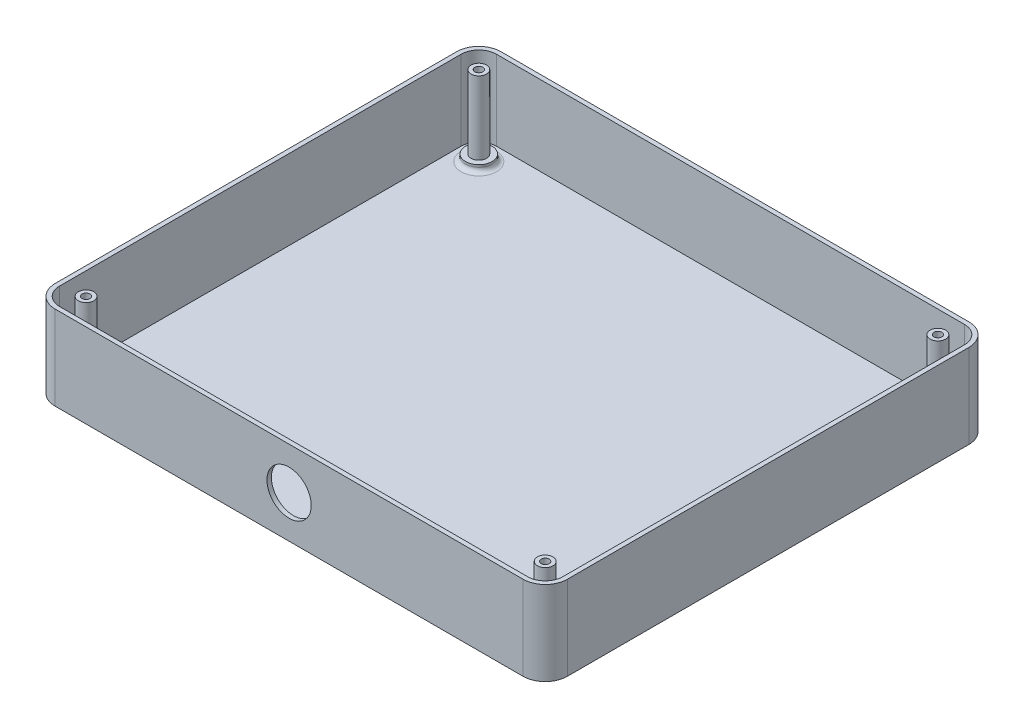
ISO-10303-21;
HEADER;
FILE_DESCRIPTION(('STEP AP214'),'2;1');
FILE_NAME('part.step','',(''),(''),'','','');
FILE_SCHEMA(('AUTOMOTIVE_DESIGN { 1 0 10303 214 1 1 1 1 }'));
ENDSEC;
DATA;
#1=APPLICATION_CONTEXT('core data for automotive mechanical design processes');
#2=APPLICATION_PROTOCOL_DEFINITION('international standard','automotive_design',2000,#1);
#3=PRODUCT_CONTEXT('',#1,'mechanical');
#4=PRODUCT('Part','Part','',(#3));
#5=PRODUCT_RELATED_PRODUCT_CATEGORY('part','',(#4));
#6=PRODUCT_DEFINITION_FORMATION('','',#4);
#7=PRODUCT_DEFINITION_CONTEXT('part definition',#1,'design');
#8=PRODUCT_DEFINITION('design','',#6,#7);
#9=PRODUCT_DEFINITION_SHAPE('','',#8);
#10=(LENGTH_UNIT() NAMED_UNIT(*) SI_UNIT(.MILLI.,.METRE.));
#11=(NAMED_UNIT(*) PLANE_ANGLE_UNIT() SI_UNIT($,.RADIAN.));
#12=(NAMED_UNIT(*) SI_UNIT($,.STERADIAN.) SOLID_ANGLE_UNIT());
#13=UNCERTAINTY_MEASURE_WITH_UNIT(LENGTH_MEASURE(1.E-05),#10,'distance_accuracy_value','');
#14=(GEOMETRIC_REPRESENTATION_CONTEXT(3) GLOBAL_UNCERTAINTY_ASSIGNED_CONTEXT((#13)) GLOBAL_UNIT_ASSIGNED_CONTEXT((#10,
#11,#12)) REPRESENTATION_CONTEXT('',''));
#15=CARTESIAN_POINT('',(0.,0.,0.));
#16=DIRECTION('',(0.,0.,1.));
#17=DIRECTION('',(1.,0.,0.));
#18=AXIS2_PLACEMENT_3D('',#15,#16,#17);
#19=CARTESIAN_POINT('',(-115.7,38.,-100.7));
#20=DIRECTION('',(1.,0.,0.));
#21=DIRECTION('',(0.,0.,-1.));
#22=AXIS2_PLACEMENT_3D('',#19,#20,#21);
#23=PLANE('',#22);
#24=DIRECTION('',(0.,0.,1.));
#25=VECTOR('',#24,1.);
#26=CARTESIAN_POINT('',(-115.7,38.,-100.7));
#27=LINE('',#26,#25);
#28=CARTESIAN_POINT('',(-115.7,38.,-90.7));
#29=VERTEX_POINT('',#28);
#30=CARTESIAN_POINT('',(-115.7,38.,90.7));
#31=VERTEX_POINT('',#30);
#32=EDGE_CURVE('E217',#29,#31,#27,.T.);
#33=ORIENTED_EDGE('',*,*,#32,.F.);
#34=DIRECTION('',(0.,-1.,0.));
#35=VECTOR('',#34,1.);
#36=CARTESIAN_POINT('',(-115.7,38.,-90.7));
#37=LINE('',#36,#35);
#38=CARTESIAN_POINT('',(-115.7,0.,-90.7));
#39=VERTEX_POINT('',#38);
#40=EDGE_CURVE('E251',#29,#39,#37,.T.);
#41=ORIENTED_EDGE('',*,*,#40,.T.);
#42=DIRECTION('',(0.,0.,1.));
#43=VECTOR('',#42,1.);
#44=CARTESIAN_POINT('',(-115.7,0.,-100.7));
#45=LINE('',#44,#43);
#46=CARTESIAN_POINT('',(-115.7,0.,90.7));
#47=VERTEX_POINT('',#46);
#48=EDGE_CURVE('E234',#39,#47,#45,.T.);
#49=ORIENTED_EDGE('',*,*,#48,.T.);
#50=DIRECTION('',(0.,-1.,0.));
#51=VECTOR('',#50,1.);
#52=CARTESIAN_POINT('',(-115.7,38.,90.7));
#53=LINE('',#52,#51);
#54=EDGE_CURVE('E233',#47,#31,#53,.F.);
#55=ORIENTED_EDGE('',*,*,#54,.T.);
#56=EDGE_LOOP('',(#33,#41,#49,#55));
#57=FACE_BOUND('',#56,.T.);
#58=ADVANCED_FACE('F39',(#57),#23,.F.);
#59=CARTESIAN_POINT('',(-115.7,38.,100.7));
#60=DIRECTION('',(0.,0.,-1.));
#61=DIRECTION('',(-1.,0.,0.));
#62=AXIS2_PLACEMENT_3D('',#59,#60,#61);
#63=PLANE('',#62);
#64=CARTESIAN_POINT('',(0.,19.,100.7));
#65=DIRECTION('',(0.,0.,1.));
#66=DIRECTION('',(1.,0.,0.));
#67=AXIS2_PLACEMENT_3D('',#64,#65,#66);
#68=CIRCLE('',#67,10.);
#69=CARTESIAN_POINT('',(10.,19.,100.7));
#70=VERTEX_POINT('',#69);
#71=EDGE_CURVE('E463',#70,#70,#68,.T.);
#72=ORIENTED_EDGE('',*,*,#71,.F.);
#73=EDGE_LOOP('',(#72));
#74=FACE_BOUND('',#73,.T.);
#75=DIRECTION('',(1.,0.,0.));
#76=VECTOR('',#75,1.);
#77=CARTESIAN_POINT('',(-115.7,0.,100.7));
#78=LINE('',#77,#76);
#79=CARTESIAN_POINT('',(-105.7,0.,100.7));
#80=VERTEX_POINT('',#79);
#81=CARTESIAN_POINT('',(105.7,0.,100.7));
#82=VERTEX_POINT('',#81);
#83=EDGE_CURVE('E238',#80,#82,#78,.T.);
#84=ORIENTED_EDGE('',*,*,#83,.T.);
#85=DIRECTION('',(0.,-1.,0.));
#86=VECTOR('',#85,1.);
#87=CARTESIAN_POINT('',(105.7,38.,100.7));
#88=LINE('',#87,#86);
#89=CARTESIAN_POINT('',(105.7,38.,100.7));
#90=VERTEX_POINT('',#89);
#91=EDGE_CURVE('E296',#82,#90,#88,.F.);
#92=ORIENTED_EDGE('',*,*,#91,.T.);
#93=DIRECTION('',(1.,0.,0.));
#94=VECTOR('',#93,1.);
#95=CARTESIAN_POINT('',(-115.7,38.,100.7));
#96=LINE('',#95,#94);
#97=CARTESIAN_POINT('',(-105.7,38.,100.7));
#98=VERTEX_POINT('',#97);
#99=EDGE_CURVE('E221',#98,#90,#96,.T.);
#100=ORIENTED_EDGE('',*,*,#99,.F.);
#101=DIRECTION('',(0.,-1.,0.));
#102=VECTOR('',#101,1.);
#103=CARTESIAN_POINT('',(-105.7,38.,100.7));
#104=LINE('',#103,#102);
#105=EDGE_CURVE('E292',#98,#80,#104,.T.);
#106=ORIENTED_EDGE('',*,*,#105,.T.);
#107=EDGE_LOOP('',(#84,#92,#100,#106));
#108=FACE_BOUND('',#107,.T.);
#109=ADVANCED_FACE('F357',(#74,#108),#63,.F.);
#110=CARTESIAN_POINT('',(115.7,38.,-100.7));
#111=DIRECTION('',(-1.,0.,0.));
#112=DIRECTION('',(0.,0.,1.));
#113=AXIS2_PLACEMENT_3D('',#110,#111,#112);
#114=PLANE('',#113);
#115=DIRECTION('',(0.,0.,-1.));
#116=VECTOR('',#115,1.);
#117=CARTESIAN_POINT('',(115.7,0.,-100.7));
#118=LINE('',#117,#116);
#119=CARTESIAN_POINT('',(115.7,0.,90.6999999999999));
#120=VERTEX_POINT('',#119);
#121=CARTESIAN_POINT('',(115.7,0.,-90.7));
#122=VERTEX_POINT('',#121);
#123=EDGE_CURVE('E243',#120,#122,#118,.T.);
#124=ORIENTED_EDGE('',*,*,#123,.T.);
#125=DIRECTION('',(0.,-1.,0.));
#126=VECTOR('',#125,1.);
#127=CARTESIAN_POINT('',(115.7,38.,-90.7));
#128=LINE('',#127,#126);
#129=CARTESIAN_POINT('',(115.7,38.,-90.7));
#130=VERTEX_POINT('',#129);
#131=EDGE_CURVE('E63',#122,#130,#128,.F.);
#132=ORIENTED_EDGE('',*,*,#131,.T.);
#133=DIRECTION('',(0.,0.,-1.));
#134=VECTOR('',#133,1.);
#135=CARTESIAN_POINT('',(115.7,38.,-100.7));
#136=LINE('',#135,#134);
#137=CARTESIAN_POINT('',(115.7,38.,90.6999999999999));
#138=VERTEX_POINT('',#137);
#139=EDGE_CURVE('E226',#138,#130,#136,.T.);
#140=ORIENTED_EDGE('',*,*,#139,.F.);
#141=DIRECTION('',(0.,-1.,0.));
#142=VECTOR('',#141,1.);
#143=CARTESIAN_POINT('',(115.7,38.,90.7));
#144=LINE('',#143,#142);
#145=EDGE_CURVE('E286',#138,#120,#144,.T.);
#146=ORIENTED_EDGE('',*,*,#145,.T.);
#147=EDGE_LOOP('',(#124,#132,#140,#146));
#148=FACE_BOUND('',#147,.T.);
#149=ADVANCED_FACE('F363',(#148),#114,.F.);
#150=CARTESIAN_POINT('',(-115.7,38.,-100.7));
#151=DIRECTION('',(0.,0.,1.));
#152=DIRECTION('',(1.,0.,0.));
#153=AXIS2_PLACEMENT_3D('',#150,#151,#152);
#154=PLANE('',#153);
#155=DIRECTION('',(-1.,0.,0.));
#156=VECTOR('',#155,1.);
#157=CARTESIAN_POINT('',(-115.7,0.,-100.7));
#158=LINE('',#157,#156);
#159=CARTESIAN_POINT('',(105.7,0.,-100.7));
#160=VERTEX_POINT('',#159);
#161=CARTESIAN_POINT('',(-105.7,0.,-100.7));
#162=VERTEX_POINT('',#161);
#163=EDGE_CURVE('E222',#160,#162,#158,.T.);
#164=ORIENTED_EDGE('',*,*,#163,.T.);
#165=DIRECTION('',(0.,-1.,0.));
#166=VECTOR('',#165,1.);
#167=CARTESIAN_POINT('',(-105.7,38.,-100.7));
#168=LINE('',#167,#166);
#169=CARTESIAN_POINT('',(-105.7,38.,-100.7));
#170=VERTEX_POINT('',#169);
#171=EDGE_CURVE('E271',#162,#170,#168,.F.);
#172=ORIENTED_EDGE('',*,*,#171,.T.);
#173=DIRECTION('',(-1.,0.,0.));
#174=VECTOR('',#173,1.);
#175=CARTESIAN_POINT('',(-115.7,38.,-100.7));
#176=LINE('',#175,#174);
#177=CARTESIAN_POINT('',(105.7,38.,-100.7));
#178=VERTEX_POINT('',#177);
#179=EDGE_CURVE('E229',#178,#170,#176,.T.);
#180=ORIENTED_EDGE('',*,*,#179,.F.);
#181=DIRECTION('',(0.,-1.,0.));
#182=VECTOR('',#181,1.);
#183=CARTESIAN_POINT('',(105.7,38.,-100.7));
#184=LINE('',#183,#182);
#185=EDGE_CURVE('E267',#178,#160,#184,.T.);
#186=ORIENTED_EDGE('',*,*,#185,.T.);
#187=EDGE_LOOP('',(#164,#172,#180,#186));
#188=FACE_BOUND('',#187,.T.);
#189=ADVANCED_FACE('F550',(#188),#154,.F.);
#190=CARTESIAN_POINT('',(0.,38.,0.));
#191=DIRECTION('',(0.,1.,0.));
#192=DIRECTION('',(0.,0.,1.));
#193=AXIS2_PLACEMENT_3D('',#190,#191,#192);
#194=PLANE('',#193);
#195=DIRECTION('',(-1.,0.,0.));
#196=VECTOR('',#195,1.);
#197=CARTESIAN_POINT('',(-115.7,38.,-98.7));
#198=LINE('',#197,#196);
#199=CARTESIAN_POINT('',(105.7,38.,-98.7));
#200=VERTEX_POINT('',#199);
#201=CARTESIAN_POINT('',(-105.7,38.,-98.7));
#202=VERTEX_POINT('',#201);
#203=EDGE_CURVE('E184',#200,#202,#198,.T.);
#204=ORIENTED_EDGE('',*,*,#203,.F.);
#205=CARTESIAN_POINT('',(105.7,38.,-90.7));
#206=DIRECTION('',(0.,1.,0.));
#207=DIRECTION('',(0.,0.,1.));
#208=AXIS2_PLACEMENT_3D('',#205,#206,#207);
#209=CIRCLE('',#208,8.);
#210=CARTESIAN_POINT('',(113.7,38.,-90.7));
#211=VERTEX_POINT('',#210);
#212=EDGE_CURVE('E205',#211,#200,#209,.T.);
#213=ORIENTED_EDGE('',*,*,#212,.F.);
#214=DIRECTION('',(0.,0.,-1.));
#215=VECTOR('',#214,1.);
#216=CARTESIAN_POINT('',(113.7,38.,-100.7));
#217=LINE('',#216,#215);
#218=CARTESIAN_POINT('',(113.7,38.,90.6999999999999));
#219=VERTEX_POINT('',#218);
#220=EDGE_CURVE('E55',#219,#211,#217,.T.);
#221=ORIENTED_EDGE('',*,*,#220,.F.);
#222=CARTESIAN_POINT('',(105.7,38.,90.7));
#223=DIRECTION('',(0.,1.,0.));
#224=DIRECTION('',(0.,0.,1.));
#225=AXIS2_PLACEMENT_3D('',#222,#223,#224);
#226=CIRCLE('',#225,8.);
#227=CARTESIAN_POINT('',(105.7,38.,98.7));
#228=VERTEX_POINT('',#227);
#229=EDGE_CURVE('E191',#228,#219,#226,.T.);
#230=ORIENTED_EDGE('',*,*,#229,.F.);
#231=DIRECTION('',(1.,0.,0.));
#232=VECTOR('',#231,1.);
#233=CARTESIAN_POINT('',(-115.7,38.,98.7));
#234=LINE('',#233,#232);
#235=CARTESIAN_POINT('',(-105.7,38.,98.7));
#236=VERTEX_POINT('',#235);
#237=EDGE_CURVE('E198',#236,#228,#234,.T.);
#238=ORIENTED_EDGE('',*,*,#237,.F.);
#239=CARTESIAN_POINT('',(-105.7,38.,90.7));
#240=DIRECTION('',(0.,1.,0.));
#241=DIRECTION('',(0.,0.,1.));
#242=AXIS2_PLACEMENT_3D('',#239,#240,#241);
#243=CIRCLE('',#242,8.);
#244=CARTESIAN_POINT('',(-113.7,38.,90.7));
#245=VERTEX_POINT('',#244);
#246=EDGE_CURVE('E187',#245,#236,#243,.T.);
#247=ORIENTED_EDGE('',*,*,#246,.F.);
#248=DIRECTION('',(0.,0.,1.));
#249=VECTOR('',#248,1.);
#250=CARTESIAN_POINT('',(-113.7,38.,-100.7));
#251=LINE('',#250,#249);
#252=CARTESIAN_POINT('',(-113.7,38.,-90.7));
#253=VERTEX_POINT('',#252);
#254=EDGE_CURVE('E179',#253,#245,#251,.T.);
#255=ORIENTED_EDGE('',*,*,#254,.F.);
#256=CARTESIAN_POINT('',(-105.7,38.,-90.7));
#257=DIRECTION('',(0.,1.,0.));
#258=DIRECTION('',(0.,0.,1.));
#259=AXIS2_PLACEMENT_3D('',#256,#257,#258);
#260=CIRCLE('',#259,8.);
#261=EDGE_CURVE('E210',#202,#253,#260,.T.);
#262=ORIENTED_EDGE('',*,*,#261,.F.);
#263=EDGE_LOOP('',(#204,#213,#221,#230,#238,#247,#255,#262));
#264=FACE_BOUND('',#263,.T.);
#265=ORIENTED_EDGE('',*,*,#179,.T.);
#266=CARTESIAN_POINT('',(-105.7,38.,-90.7));
#267=DIRECTION('',(0.,1.,0.));
#268=DIRECTION('',(0.,0.,1.));
#269=AXIS2_PLACEMENT_3D('',#266,#267,#268);
#270=CIRCLE('',#269,10.);
#271=EDGE_CURVE('E283',#170,#29,#270,.T.);
#272=ORIENTED_EDGE('',*,*,#271,.T.);
#273=ORIENTED_EDGE('',*,*,#32,.T.);
#274=CARTESIAN_POINT('',(-105.7,38.,90.7));
#275=DIRECTION('',(0.,1.,0.));
#276=DIRECTION('',(0.,0.,1.));
#277=AXIS2_PLACEMENT_3D('',#274,#275,#276);
#278=CIRCLE('',#277,10.);
#279=EDGE_CURVE('E274',#31,#98,#278,.T.);
#280=ORIENTED_EDGE('',*,*,#279,.T.);
#281=ORIENTED_EDGE('',*,*,#99,.T.);
#282=CARTESIAN_POINT('',(105.7,38.,90.7));
#283=DIRECTION('',(0.,1.,0.));
#284=DIRECTION('',(0.,0.,1.));
#285=AXIS2_PLACEMENT_3D('',#282,#283,#284);
#286=CIRCLE('',#285,10.);
#287=EDGE_CURVE('E277',#90,#138,#286,.T.);
#288=ORIENTED_EDGE('',*,*,#287,.T.);
#289=ORIENTED_EDGE('',*,*,#139,.T.);
#290=CARTESIAN_POINT('',(105.7,38.,-90.7));
#291=DIRECTION('',(0.,1.,0.));
#292=DIRECTION('',(0.,0.,1.));
#293=AXIS2_PLACEMENT_3D('',#290,#291,#292);
#294=CIRCLE('',#293,10.);
#295=EDGE_CURVE('E280',#130,#178,#294,.T.);
#296=ORIENTED_EDGE('',*,*,#295,.T.);
#297=EDGE_LOOP('',(#265,#272,#273,#280,#281,#288,#289,#296));
#298=FACE_BOUND('',#297,.T.);
#299=ADVANCED_FACE('F507',(#264,#298),#194,.T.);
#300=CARTESIAN_POINT('',(0.,0.,0.));
#301=DIRECTION('',(0.,1.,0.));
#302=DIRECTION('',(0.,0.,1.));
#303=AXIS2_PLACEMENT_3D('',#300,#301,#302);
#304=PLANE('',#303);
#305=ORIENTED_EDGE('',*,*,#48,.F.);
#306=CARTESIAN_POINT('',(-105.7,0.,-90.7));
#307=DIRECTION('',(0.,1.,0.));
#308=DIRECTION('',(0.,0.,1.));
#309=AXIS2_PLACEMENT_3D('',#306,#307,#308);
#310=CIRCLE('',#309,10.);
#311=EDGE_CURVE('E264',#39,#162,#310,.F.);
#312=ORIENTED_EDGE('',*,*,#311,.T.);
#313=ORIENTED_EDGE('',*,*,#163,.F.);
#314=CARTESIAN_POINT('',(105.7,0.,-90.7));
#315=DIRECTION('',(0.,1.,0.));
#316=DIRECTION('',(0.,0.,1.));
#317=AXIS2_PLACEMENT_3D('',#314,#315,#316);
#318=CIRCLE('',#317,10.);
#319=EDGE_CURVE('E261',#160,#122,#318,.F.);
#320=ORIENTED_EDGE('',*,*,#319,.T.);
#321=ORIENTED_EDGE('',*,*,#123,.F.);
#322=CARTESIAN_POINT('',(105.7,0.,90.7));
#323=DIRECTION('',(0.,1.,0.));
#324=DIRECTION('',(0.,0.,1.));
#325=AXIS2_PLACEMENT_3D('',#322,#323,#324);
#326=CIRCLE('',#325,10.);
#327=EDGE_CURVE('E258',#120,#82,#326,.F.);
#328=ORIENTED_EDGE('',*,*,#327,.T.);
#329=ORIENTED_EDGE('',*,*,#83,.F.);
#330=CARTESIAN_POINT('',(-105.7,0.,90.7));
#331=DIRECTION('',(0.,1.,0.));
#332=DIRECTION('',(0.,0.,1.));
#333=AXIS2_PLACEMENT_3D('',#330,#331,#332);
#334=CIRCLE('',#333,10.);
#335=EDGE_CURVE('E255',#80,#47,#334,.F.);
#336=ORIENTED_EDGE('',*,*,#335,.T.);
#337=EDGE_LOOP('',(#305,#312,#313,#320,#321,#328,#329,#336));
#338=FACE_BOUND('',#337,.T.);
#339=ADVANCED_FACE('F373',(#338),#304,.F.);
#340=CARTESIAN_POINT('',(-105.7,38.,-90.7));
#341=DIRECTION('',(0.,-1.,0.));
#342=DIRECTION('',(0.,0.,-1.));
#343=AXIS2_PLACEMENT_3D('',#340,#341,#342);
#344=CYLINDRICAL_SURFACE('',#343,10.);
#345=ORIENTED_EDGE('',*,*,#271,.F.);
#346=ORIENTED_EDGE('',*,*,#171,.F.);
#347=ORIENTED_EDGE('',*,*,#311,.F.);
#348=ORIENTED_EDGE('',*,*,#40,.F.);
#349=EDGE_LOOP('',(#345,#346,#347,#348));
#350=FACE_BOUND('',#349,.T.);
#351=ADVANCED_FACE('F369',(#350),#344,.T.);
#352=CARTESIAN_POINT('',(105.7,38.,-90.7));
#353=DIRECTION('',(0.,-1.,0.));
#354=DIRECTION('',(0.,0.,-1.));
#355=AXIS2_PLACEMENT_3D('',#352,#353,#354);
#356=CYLINDRICAL_SURFACE('',#355,10.);
#357=ORIENTED_EDGE('',*,*,#295,.F.);
#358=ORIENTED_EDGE('',*,*,#131,.F.);
#359=ORIENTED_EDGE('',*,*,#319,.F.);
#360=ORIENTED_EDGE('',*,*,#185,.F.);
#361=EDGE_LOOP('',(#357,#358,#359,#360));
#362=FACE_BOUND('',#361,.T.);
#363=ADVANCED_FACE('F372',(#362),#356,.T.);
#364=CARTESIAN_POINT('',(105.7,38.,90.7));
#365=DIRECTION('',(0.,-1.,0.));
#366=DIRECTION('',(0.,0.,-1.));
#367=AXIS2_PLACEMENT_3D('',#364,#365,#366);
#368=CYLINDRICAL_SURFACE('',#367,10.);
#369=ORIENTED_EDGE('',*,*,#287,.F.);
#370=ORIENTED_EDGE('',*,*,#91,.F.);
#371=ORIENTED_EDGE('',*,*,#327,.F.);
#372=ORIENTED_EDGE('',*,*,#145,.F.);
#373=EDGE_LOOP('',(#369,#370,#371,#372));
#374=FACE_BOUND('',#373,.T.);
#375=ADVANCED_FACE('F377',(#374),#368,.T.);
#376=CARTESIAN_POINT('',(-105.7,38.,90.7));
#377=DIRECTION('',(0.,-1.,0.));
#378=DIRECTION('',(0.,0.,-1.));
#379=AXIS2_PLACEMENT_3D('',#376,#377,#378);
#380=CYLINDRICAL_SURFACE('',#379,10.);
#381=ORIENTED_EDGE('',*,*,#279,.F.);
#382=ORIENTED_EDGE('',*,*,#54,.F.);
#383=ORIENTED_EDGE('',*,*,#335,.F.);
#384=ORIENTED_EDGE('',*,*,#105,.F.);
#385=EDGE_LOOP('',(#381,#382,#383,#384));
#386=FACE_BOUND('',#385,.T.);
#387=ADVANCED_FACE('F381',(#386),#380,.T.);
#388=CARTESIAN_POINT('',(-113.7,38.,-100.7));
#389=DIRECTION('',(1.,0.,0.));
#390=DIRECTION('',(0.,0.,-1.));
#391=AXIS2_PLACEMENT_3D('',#388,#389,#390);
#392=PLANE('',#391);
#393=ORIENTED_EDGE('',*,*,#254,.T.);
#394=DIRECTION('',(0.,1.,0.));
#395=VECTOR('',#394,1.);
#396=CARTESIAN_POINT('',(-113.7,38.,90.7));
#397=LINE('',#396,#395);
#398=CARTESIAN_POINT('',(-113.7,2.,90.7));
#399=VERTEX_POINT('',#398);
#400=EDGE_CURVE('E213',#399,#245,#397,.T.);
#401=ORIENTED_EDGE('',*,*,#400,.F.);
#402=DIRECTION('',(0.,0.,1.));
#403=VECTOR('',#402,1.);
#404=CARTESIAN_POINT('',(-113.7,2.,-100.7));
#405=LINE('',#404,#403);
#406=CARTESIAN_POINT('',(-113.7,2.,-90.7));
#407=VERTEX_POINT('',#406);
#408=EDGE_CURVE('E468',#407,#399,#405,.T.);
#409=ORIENTED_EDGE('',*,*,#408,.F.);
#410=DIRECTION('',(0.,1.,0.));
#411=VECTOR('',#410,1.);
#412=CARTESIAN_POINT('',(-113.7,38.,-90.7));
#413=LINE('',#412,#411);
#414=EDGE_CURVE('E163',#253,#407,#413,.F.);
#415=ORIENTED_EDGE('',*,*,#414,.F.);
#416=EDGE_LOOP('',(#393,#401,#409,#415));
#417=FACE_BOUND('',#416,.T.);
#418=ADVANCED_FACE('F385',(#417),#392,.T.);
#419=CARTESIAN_POINT('',(-115.7,38.,98.7));
#420=DIRECTION('',(0.,0.,-1.));
#421=DIRECTION('',(-1.,0.,0.));
#422=AXIS2_PLACEMENT_3D('',#419,#420,#421);
#423=PLANE('',#422);
#424=CARTESIAN_POINT('',(0.,19.,98.7));
#425=DIRECTION('',(0.,0.,1.));
#426=DIRECTION('',(1.,0.,0.));
#427=AXIS2_PLACEMENT_3D('',#424,#425,#426);
#428=CIRCLE('',#427,10.);
#429=CARTESIAN_POINT('',(10.,19.,98.7));
#430=VERTEX_POINT('',#429);
#431=EDGE_CURVE('E464',#430,#430,#428,.T.);
#432=ORIENTED_EDGE('',*,*,#431,.T.);
#433=EDGE_LOOP('',(#432));
#434=FACE_BOUND('',#433,.T.);
#435=DIRECTION('',(1.,0.,0.));
#436=VECTOR('',#435,1.);
#437=CARTESIAN_POINT('',(-115.7,2.,98.7));
#438=LINE('',#437,#436);
#439=CARTESIAN_POINT('',(-105.7,2.,98.7));
#440=VERTEX_POINT('',#439);
#441=CARTESIAN_POINT('',(105.7,2.,98.7));
#442=VERTEX_POINT('',#441);
#443=EDGE_CURVE('E477',#440,#442,#438,.T.);
#444=ORIENTED_EDGE('',*,*,#443,.F.);
#445=DIRECTION('',(0.,1.,0.));
#446=VECTOR('',#445,1.);
#447=CARTESIAN_POINT('',(-105.7,38.,98.7));
#448=LINE('',#447,#446);
#449=EDGE_CURVE('E494',#236,#440,#448,.F.);
#450=ORIENTED_EDGE('',*,*,#449,.F.);
#451=ORIENTED_EDGE('',*,*,#237,.T.);
#452=DIRECTION('',(0.,1.,0.));
#453=VECTOR('',#452,1.);
#454=CARTESIAN_POINT('',(105.7,38.,98.7));
#455=LINE('',#454,#453);
#456=EDGE_CURVE('E239',#442,#228,#455,.T.);
#457=ORIENTED_EDGE('',*,*,#456,.F.);
#458=EDGE_LOOP('',(#444,#450,#451,#457));
#459=FACE_BOUND('',#458,.T.);
#460=ADVANCED_FACE('F521',(#434,#459),#423,.T.);
#461=CARTESIAN_POINT('',(113.7,38.,-100.7));
#462=DIRECTION('',(-1.,0.,0.));
#463=DIRECTION('',(0.,0.,1.));
#464=AXIS2_PLACEMENT_3D('',#461,#462,#463);
#465=PLANE('',#464);
#466=DIRECTION('',(0.,0.,-1.));
#467=VECTOR('',#466,1.);
#468=CARTESIAN_POINT('',(113.7,2.,-100.7));
#469=LINE('',#468,#467);
#470=CARTESIAN_POINT('',(113.7,2.,90.6999999999999));
#471=VERTEX_POINT('',#470);
#472=CARTESIAN_POINT('',(113.7,2.,-90.7));
#473=VERTEX_POINT('',#472);
#474=EDGE_CURVE('E180',#471,#473,#469,.T.);
#475=ORIENTED_EDGE('',*,*,#474,.F.);
#476=DIRECTION('',(0.,1.,0.));
#477=VECTOR('',#476,1.);
#478=CARTESIAN_POINT('',(113.7,38.,90.6999999999999));
#479=LINE('',#478,#477);
#480=EDGE_CURVE('E216',#219,#471,#479,.F.);
#481=ORIENTED_EDGE('',*,*,#480,.F.);
#482=ORIENTED_EDGE('',*,*,#220,.T.);
#483=DIRECTION('',(0.,1.,0.));
#484=VECTOR('',#483,1.);
#485=CARTESIAN_POINT('',(113.7,38.,-90.7));
#486=LINE('',#485,#484);
#487=EDGE_CURVE('E498',#473,#211,#486,.T.);
#488=ORIENTED_EDGE('',*,*,#487,.F.);
#489=EDGE_LOOP('',(#475,#481,#482,#488));
#490=FACE_BOUND('',#489,.T.);
#491=ADVANCED_FACE('F524',(#490),#465,.T.);
#492=CARTESIAN_POINT('',(-115.7,38.,-98.7));
#493=DIRECTION('',(0.,0.,1.));
#494=DIRECTION('',(1.,0.,0.));
#495=AXIS2_PLACEMENT_3D('',#492,#493,#494);
#496=PLANE('',#495);
#497=DIRECTION('',(-1.,0.,0.));
#498=VECTOR('',#497,1.);
#499=CARTESIAN_POINT('',(-115.7,2.,-98.7));
#500=LINE('',#499,#498);
#501=CARTESIAN_POINT('',(105.7,2.,-98.7));
#502=VERTEX_POINT('',#501);
#503=CARTESIAN_POINT('',(-105.7,2.,-98.7));
#504=VERTEX_POINT('',#503);
#505=EDGE_CURVE('E172',#502,#504,#500,.T.);
#506=ORIENTED_EDGE('',*,*,#505,.F.);
#507=DIRECTION('',(0.,1.,0.));
#508=VECTOR('',#507,1.);
#509=CARTESIAN_POINT('',(105.7,38.,-98.7));
#510=LINE('',#509,#508);
#511=EDGE_CURVE('E168',#200,#502,#510,.F.);
#512=ORIENTED_EDGE('',*,*,#511,.F.);
#513=ORIENTED_EDGE('',*,*,#203,.T.);
#514=DIRECTION('',(0.,1.,0.));
#515=VECTOR('',#514,1.);
#516=CARTESIAN_POINT('',(-105.7,38.,-98.7));
#517=LINE('',#516,#515);
#518=EDGE_CURVE('E160',#504,#202,#517,.T.);
#519=ORIENTED_EDGE('',*,*,#518,.F.);
#520=EDGE_LOOP('',(#506,#512,#513,#519));
#521=FACE_BOUND('',#520,.T.);
#522=ADVANCED_FACE('F182',(#521),#496,.T.);
#523=CARTESIAN_POINT('',(0.,2.,0.));
#524=DIRECTION('',(0.,1.,0.));
#525=DIRECTION('',(0.,0.,1.));
#526=AXIS2_PLACEMENT_3D('',#523,#524,#525);
#527=PLANE('',#526);
#528=CARTESIAN_POINT('',(-103.7,2.,88.7));
#529=DIRECTION('',(0.,1.,0.));
#530=DIRECTION('',(0.,0.,1.));
#531=AXIS2_PLACEMENT_3D('',#528,#529,#530);
#532=CIRCLE('',#531,8.);
#533=CARTESIAN_POINT('',(-103.7,2.,96.7));
#534=VERTEX_POINT('',#533);
#535=EDGE_CURVE('E11',#534,#534,#532,.F.);
#536=ORIENTED_EDGE('',*,*,#535,.T.);
#537=EDGE_LOOP('',(#536));
#538=FACE_BOUND('',#537,.T.);
#539=CARTESIAN_POINT('',(103.7,2.,88.7));
#540=DIRECTION('',(0.,1.,0.));
#541=DIRECTION('',(0.,0.,1.));
#542=AXIS2_PLACEMENT_3D('',#539,#540,#541);
#543=CIRCLE('',#542,8.);
#544=CARTESIAN_POINT('',(103.7,2.,96.7));
#545=VERTEX_POINT('',#544);
#546=EDGE_CURVE('E331',#545,#545,#543,.F.);
#547=ORIENTED_EDGE('',*,*,#546,.T.);
#548=EDGE_LOOP('',(#547));
#549=FACE_BOUND('',#548,.T.);
#550=CARTESIAN_POINT('',(103.7,2.,-88.7));
#551=DIRECTION('',(0.,1.,0.));
#552=DIRECTION('',(0.,0.,1.));
#553=AXIS2_PLACEMENT_3D('',#550,#551,#552);
#554=CIRCLE('',#553,8.);
#555=CARTESIAN_POINT('',(103.7,2.,-80.7));
#556=VERTEX_POINT('',#555);
#557=EDGE_CURVE('E319',#556,#556,#554,.F.);
#558=ORIENTED_EDGE('',*,*,#557,.T.);
#559=EDGE_LOOP('',(#558));
#560=FACE_BOUND('',#559,.T.);
#561=CARTESIAN_POINT('',(-103.7,2.,-88.7));
#562=DIRECTION('',(0.,1.,0.));
#563=DIRECTION('',(0.,0.,1.));
#564=AXIS2_PLACEMENT_3D('',#561,#562,#563);
#565=CIRCLE('',#564,8.);
#566=CARTESIAN_POINT('',(-103.7,2.,-80.7));
#567=VERTEX_POINT('',#566);
#568=EDGE_CURVE('E307',#567,#567,#565,.F.);
#569=ORIENTED_EDGE('',*,*,#568,.T.);
#570=EDGE_LOOP('',(#569));
#571=FACE_BOUND('',#570,.T.);
#572=ORIENTED_EDGE('',*,*,#408,.T.);
#573=CARTESIAN_POINT('',(-105.7,2.,90.7));
#574=DIRECTION('',(0.,1.,0.));
#575=DIRECTION('',(0.,0.,1.));
#576=AXIS2_PLACEMENT_3D('',#573,#574,#575);
#577=CIRCLE('',#576,8.);
#578=EDGE_CURVE('E474',#440,#399,#577,.F.);
#579=ORIENTED_EDGE('',*,*,#578,.F.);
#580=ORIENTED_EDGE('',*,*,#443,.T.);
#581=CARTESIAN_POINT('',(105.7,2.,90.7));
#582=DIRECTION('',(0.,1.,0.));
#583=DIRECTION('',(0.,0.,1.));
#584=AXIS2_PLACEMENT_3D('',#581,#582,#583);
#585=CIRCLE('',#584,8.);
#586=EDGE_CURVE('E482',#471,#442,#585,.F.);
#587=ORIENTED_EDGE('',*,*,#586,.F.);
#588=ORIENTED_EDGE('',*,*,#474,.T.);
#589=CARTESIAN_POINT('',(105.7,2.,-90.7));
#590=DIRECTION('',(0.,1.,0.));
#591=DIRECTION('',(0.,0.,1.));
#592=AXIS2_PLACEMENT_3D('',#589,#590,#591);
#593=CIRCLE('',#592,8.);
#594=EDGE_CURVE('E169',#502,#473,#593,.F.);
#595=ORIENTED_EDGE('',*,*,#594,.F.);
#596=ORIENTED_EDGE('',*,*,#505,.T.);
#597=CARTESIAN_POINT('',(-105.7,2.,-90.7));
#598=DIRECTION('',(0.,1.,0.));
#599=DIRECTION('',(0.,0.,1.));
#600=AXIS2_PLACEMENT_3D('',#597,#598,#599);
#601=CIRCLE('',#600,8.);
#602=EDGE_CURVE('E156',#407,#504,#601,.F.);
#603=ORIENTED_EDGE('',*,*,#602,.F.);
#604=EDGE_LOOP('',(#572,#579,#580,#587,#588,#595,#596,#603));
#605=FACE_BOUND('',#604,.T.);
#606=ADVANCED_FACE('F173',(#538,#549,#560,#571,#605),#527,.T.);
#607=CARTESIAN_POINT('',(-105.7,38.,-90.7));
#608=DIRECTION('',(0.,-1.,0.));
#609=DIRECTION('',(0.,0.,-1.));
#610=AXIS2_PLACEMENT_3D('',#607,#608,#609);
#611=CYLINDRICAL_SURFACE('',#610,8.);
#612=ORIENTED_EDGE('',*,*,#261,.T.);
#613=ORIENTED_EDGE('',*,*,#414,.T.);
#614=ORIENTED_EDGE('',*,*,#602,.T.);
#615=ORIENTED_EDGE('',*,*,#518,.T.);
#616=EDGE_LOOP('',(#612,#613,#614,#615));
#617=FACE_BOUND('',#616,.T.);
#618=ADVANCED_FACE('F158',(#617),#611,.F.);
#619=CARTESIAN_POINT('',(105.7,38.,-90.7));
#620=DIRECTION('',(0.,-1.,0.));
#621=DIRECTION('',(0.,0.,-1.));
#622=AXIS2_PLACEMENT_3D('',#619,#620,#621);
#623=CYLINDRICAL_SURFACE('',#622,8.);
#624=ORIENTED_EDGE('',*,*,#212,.T.);
#625=ORIENTED_EDGE('',*,*,#511,.T.);
#626=ORIENTED_EDGE('',*,*,#594,.T.);
#627=ORIENTED_EDGE('',*,*,#487,.T.);
#628=EDGE_LOOP('',(#624,#625,#626,#627));
#629=FACE_BOUND('',#628,.T.);
#630=ADVANCED_FACE('F504',(#629),#623,.F.);
#631=CARTESIAN_POINT('',(105.7,38.,90.7));
#632=DIRECTION('',(0.,-1.,0.));
#633=DIRECTION('',(0.,0.,-1.));
#634=AXIS2_PLACEMENT_3D('',#631,#632,#633);
#635=CYLINDRICAL_SURFACE('',#634,8.);
#636=ORIENTED_EDGE('',*,*,#229,.T.);
#637=ORIENTED_EDGE('',*,*,#480,.T.);
#638=ORIENTED_EDGE('',*,*,#586,.T.);
#639=ORIENTED_EDGE('',*,*,#456,.T.);
#640=EDGE_LOOP('',(#636,#637,#638,#639));
#641=FACE_BOUND('',#640,.T.);
#642=ADVANCED_FACE('F523',(#641),#635,.F.);
#643=CARTESIAN_POINT('',(-105.7,38.,90.7));
#644=DIRECTION('',(0.,-1.,0.));
#645=DIRECTION('',(0.,0.,-1.));
#646=AXIS2_PLACEMENT_3D('',#643,#644,#645);
#647=CYLINDRICAL_SURFACE('',#646,8.);
#648=ORIENTED_EDGE('',*,*,#246,.T.);
#649=ORIENTED_EDGE('',*,*,#449,.T.);
#650=ORIENTED_EDGE('',*,*,#578,.T.);
#651=ORIENTED_EDGE('',*,*,#400,.T.);
#652=EDGE_LOOP('',(#648,#649,#650,#651));
#653=FACE_BOUND('',#652,.T.);
#654=ADVANCED_FACE('F518',(#653),#647,.F.);
#655=CARTESIAN_POINT('',(0.,19.,98.7));
#656=DIRECTION('',(0.,0.,1.));
#657=DIRECTION('',(1.,0.,0.));
#658=AXIS2_PLACEMENT_3D('',#655,#656,#657);
#659=CYLINDRICAL_SURFACE('',#658,10.);
#660=ORIENTED_EDGE('',*,*,#431,.F.);
#661=EDGE_LOOP('',(#660));
#662=FACE_BOUND('',#661,.T.);
#663=ORIENTED_EDGE('',*,*,#71,.T.);
#664=EDGE_LOOP('',(#663));
#665=FACE_BOUND('',#664,.T.);
#666=ADVANCED_FACE('F547',(#662,#665),#659,.F.);
#667=CARTESIAN_POINT('',(-103.7,5.,-88.7));
#668=DIRECTION('',(0.,-1.,0.));
#669=DIRECTION('',(0.,0.,-1.));
#670=AXIS2_PLACEMENT_3D('',#667,#668,#669);
#671=CYLINDRICAL_SURFACE('',#670,6.);
#672=CARTESIAN_POINT('',(-103.7,4.,-88.7));
#673=DIRECTION('',(0.,1.,0.));
#674=DIRECTION('',(0.,0.,1.));
#675=AXIS2_PLACEMENT_3D('',#672,#673,#674);
#676=CIRCLE('',#675,6.);
#677=CARTESIAN_POINT('',(-103.7,4.,-82.7));
#678=VERTEX_POINT('',#677);
#679=EDGE_CURVE('E303',#678,#678,#676,.T.);
#680=ORIENTED_EDGE('',*,*,#679,.T.);
#681=EDGE_LOOP('',(#680));
#682=FACE_BOUND('',#681,.T.);
#683=CARTESIAN_POINT('',(-103.7,5.,-88.7));
#684=DIRECTION('',(0.,1.,0.));
#685=DIRECTION('',(0.,0.,1.));
#686=AXIS2_PLACEMENT_3D('',#683,#684,#685);
#687=CIRCLE('',#686,6.);
#688=CARTESIAN_POINT('',(-103.7,5.,-82.7));
#689=VERTEX_POINT('',#688);
#690=EDGE_CURVE('E456',#689,#689,#687,.T.);
#691=ORIENTED_EDGE('',*,*,#690,.F.);
#692=EDGE_LOOP('',(#691));
#693=FACE_BOUND('',#692,.T.);
#694=ADVANCED_FACE('F629',(#682,#693),#671,.T.);
#695=CARTESIAN_POINT('',(-103.7,5.,-88.7));
#696=DIRECTION('',(0.,1.,0.));
#697=DIRECTION('',(0.,0.,1.));
#698=AXIS2_PLACEMENT_3D('',#695,#696,#697);
#699=PLANE('',#698);
#700=CARTESIAN_POINT('',(-103.7,5.,-88.7));
#701=DIRECTION('',(0.,1.,0.));
#702=DIRECTION('',(0.,0.,1.));
#703=AXIS2_PLACEMENT_3D('',#700,#701,#702);
#704=CIRCLE('',#703,3.50000000000001);
#705=CARTESIAN_POINT('',(-103.7,5.,-85.2));
#706=VERTEX_POINT('',#705);
#707=EDGE_CURVE('E451',#706,#706,#704,.T.);
#708=ORIENTED_EDGE('',*,*,#707,.F.);
#709=EDGE_LOOP('',(#708));
#710=FACE_BOUND('',#709,.T.);
#711=ORIENTED_EDGE('',*,*,#690,.T.);
#712=EDGE_LOOP('',(#711));
#713=FACE_BOUND('',#712,.T.);
#714=ADVANCED_FACE('F638',(#710,#713),#699,.T.);
#715=CARTESIAN_POINT('',(-103.7,38.,-88.7));
#716=DIRECTION('',(0.,1.,0.));
#717=DIRECTION('',(0.,0.,1.));
#718=AXIS2_PLACEMENT_3D('',#715,#716,#717);
#719=PLANE('',#718);
#720=CARTESIAN_POINT('',(-103.7,38.,-88.7));
#721=DIRECTION('',(0.,1.,0.));
#722=DIRECTION('',(0.,0.,1.));
#723=AXIS2_PLACEMENT_3D('',#720,#721,#722);
#724=CIRCLE('',#723,3.50000000000001);
#725=CARTESIAN_POINT('',(-103.7,38.,-85.2));
#726=VERTEX_POINT('',#725);
#727=EDGE_CURVE('E452',#726,#726,#724,.T.);
#728=ORIENTED_EDGE('',*,*,#727,.T.);
#729=EDGE_LOOP('',(#728));
#730=FACE_BOUND('',#729,.T.);
#731=CARTESIAN_POINT('',(-103.7,38.,-88.7));
#732=DIRECTION('',(0.,1.,0.));
#733=DIRECTION('',(0.,0.,1.));
#734=AXIS2_PLACEMENT_3D('',#731,#732,#733);
#735=CIRCLE('',#734,1.79999999999999);
#736=CARTESIAN_POINT('',(-103.7,38.,-86.9));
#737=VERTEX_POINT('',#736);
#738=EDGE_CURVE('E447',#737,#737,#735,.T.);
#739=ORIENTED_EDGE('',*,*,#738,.F.);
#740=EDGE_LOOP('',(#739));
#741=FACE_BOUND('',#740,.T.);
#742=ADVANCED_FACE('F643',(#730,#741),#719,.T.);
#743=CARTESIAN_POINT('',(-103.7,38.,-88.7));
#744=DIRECTION('',(0.,-1.,0.));
#745=DIRECTION('',(0.,0.,-1.));
#746=AXIS2_PLACEMENT_3D('',#743,#744,#745);
#747=CYLINDRICAL_SURFACE('',#746,3.50000000000001);
#748=ORIENTED_EDGE('',*,*,#727,.F.);
#749=EDGE_LOOP('',(#748));
#750=FACE_BOUND('',#749,.T.);
#751=ORIENTED_EDGE('',*,*,#707,.T.);
#752=EDGE_LOOP('',(#751));
#753=FACE_BOUND('',#752,.T.);
#754=ADVANCED_FACE('F654',(#750,#753),#747,.T.);
#755=CARTESIAN_POINT('',(-103.7,38.,-88.7));
#756=DIRECTION('',(0.,-1.,0.));
#757=DIRECTION('',(0.,0.,-1.));
#758=AXIS2_PLACEMENT_3D('',#755,#756,#757);
#759=CYLINDRICAL_SURFACE('',#758,1.79999999999999);
#760=ORIENTED_EDGE('',*,*,#738,.T.);
#761=EDGE_LOOP('',(#760));
#762=FACE_BOUND('',#761,.T.);
#763=CARTESIAN_POINT('',(-103.7,5.,-88.7));
#764=DIRECTION('',(0.,1.,0.));
#765=DIRECTION('',(0.,0.,1.));
#766=AXIS2_PLACEMENT_3D('',#763,#764,#765);
#767=CIRCLE('',#766,1.79999999999999);
#768=CARTESIAN_POINT('',(-103.7,5.,-86.9));
#769=VERTEX_POINT('',#768);
#770=EDGE_CURVE('E299',#769,#769,#767,.F.);
#771=ORIENTED_EDGE('',*,*,#770,.T.);
#772=EDGE_LOOP('',(#771));
#773=FACE_BOUND('',#772,.T.);
#774=ADVANCED_FACE('F664',(#762,#773),#759,.F.);
#775=ORIENTED_EDGE('',*,*,#770,.F.);
#776=EDGE_LOOP('',(#775));
#777=FACE_BOUND('',#776,.T.);
#778=ADVANCED_FACE('F391',(#777),#699,.T.);
#779=CARTESIAN_POINT('',(-103.7,4.,-88.7));
#780=DIRECTION('',(0.,1.,0.));
#781=DIRECTION('',(0.,0.,1.));
#782=AXIS2_PLACEMENT_3D('',#779,#780,#781);
#783=TOROIDAL_SURFACE('',#782,8.,2.);
#784=ORIENTED_EDGE('',*,*,#568,.F.);
#785=EDGE_LOOP('',(#784));
#786=FACE_BOUND('',#785,.T.);
#787=ORIENTED_EDGE('',*,*,#679,.F.);
#788=EDGE_LOOP('',(#787));
#789=FACE_BOUND('',#788,.T.);
#790=ADVANCED_FACE('F387',(#786,#789),#783,.F.);
#791=CARTESIAN_POINT('',(103.7,5.,-88.7));
#792=DIRECTION('',(0.,-1.,0.));
#793=DIRECTION('',(0.,0.,-1.));
#794=AXIS2_PLACEMENT_3D('',#791,#792,#793);
#795=CYLINDRICAL_SURFACE('',#794,6.);
#796=CARTESIAN_POINT('',(103.7,4.,-88.7));
#797=DIRECTION('',(0.,1.,0.));
#798=DIRECTION('',(0.,0.,1.));
#799=AXIS2_PLACEMENT_3D('',#796,#797,#798);
#800=CIRCLE('',#799,6.);
#801=CARTESIAN_POINT('',(103.7,4.,-82.7));
#802=VERTEX_POINT('',#801);
#803=EDGE_CURVE('E315',#802,#802,#800,.T.);
#804=ORIENTED_EDGE('',*,*,#803,.T.);
#805=EDGE_LOOP('',(#804));
#806=FACE_BOUND('',#805,.T.);
#807=CARTESIAN_POINT('',(103.7,5.,-88.7));
#808=DIRECTION('',(0.,-1.,0.));
#809=DIRECTION('',(0.,0.,1.));
#810=AXIS2_PLACEMENT_3D('',#807,#808,#809);
#811=CIRCLE('',#810,6.);
#812=CARTESIAN_POINT('',(103.7,5.,-82.7));
#813=VERTEX_POINT('',#812);
#814=EDGE_CURVE('E443',#813,#813,#811,.T.);
#815=ORIENTED_EDGE('',*,*,#814,.T.);
#816=EDGE_LOOP('',(#815));
#817=FACE_BOUND('',#816,.T.);
#818=ADVANCED_FACE('F390',(#806,#817),#795,.T.);
#819=CARTESIAN_POINT('',(103.7,5.,-88.7));
#820=DIRECTION('',(0.,1.,0.));
#821=DIRECTION('',(0.,0.,1.));
#822=AXIS2_PLACEMENT_3D('',#819,#820,#821);
#823=PLANE('',#822);
#824=CARTESIAN_POINT('',(103.7,5.,-88.7));
#825=DIRECTION('',(0.,1.,0.));
#826=DIRECTION('',(0.,0.,1.));
#827=AXIS2_PLACEMENT_3D('',#824,#825,#826);
#828=CIRCLE('',#827,3.50000000000001);
#829=CARTESIAN_POINT('',(103.7,5.,-85.2));
#830=VERTEX_POINT('',#829);
#831=EDGE_CURVE('E311',#830,#830,#828,.T.);
#832=ORIENTED_EDGE('',*,*,#831,.F.);
#833=EDGE_LOOP('',(#832));
#834=FACE_BOUND('',#833,.T.);
#835=ORIENTED_EDGE('',*,*,#814,.F.);
#836=EDGE_LOOP('',(#835));
#837=FACE_BOUND('',#836,.T.);
#838=ADVANCED_FACE('F703',(#834,#837),#823,.T.);
#839=CARTESIAN_POINT('',(103.7,38.,-88.7));
#840=DIRECTION('',(0.,-1.,0.));
#841=DIRECTION('',(0.,0.,-1.));
#842=AXIS2_PLACEMENT_3D('',#839,#840,#841);
#843=CYLINDRICAL_SURFACE('',#842,3.50000000000001);
#844=CARTESIAN_POINT('',(103.7,38.,-88.7));
#845=DIRECTION('',(0.,-1.,0.));
#846=DIRECTION('',(0.,0.,1.));
#847=AXIS2_PLACEMENT_3D('',#844,#845,#846);
#848=CIRCLE('',#847,3.50000000000001);
#849=CARTESIAN_POINT('',(103.7,38.,-85.2));
#850=VERTEX_POINT('',#849);
#851=EDGE_CURVE('E438',#850,#850,#848,.T.);
#852=ORIENTED_EDGE('',*,*,#851,.T.);
#853=EDGE_LOOP('',(#852));
#854=FACE_BOUND('',#853,.T.);
#855=ORIENTED_EDGE('',*,*,#831,.T.);
#856=EDGE_LOOP('',(#855));
#857=FACE_BOUND('',#856,.T.);
#858=ADVANCED_FACE('F713',(#854,#857),#843,.T.);
#859=CARTESIAN_POINT('',(103.7,38.,-88.7));
#860=DIRECTION('',(0.,1.,0.));
#861=DIRECTION('',(0.,0.,1.));
#862=AXIS2_PLACEMENT_3D('',#859,#860,#861);
#863=PLANE('',#862);
#864=CARTESIAN_POINT('',(103.7,38.,-88.7));
#865=DIRECTION('',(0.,-1.,0.));
#866=DIRECTION('',(0.,0.,1.));
#867=AXIS2_PLACEMENT_3D('',#864,#865,#866);
#868=CIRCLE('',#867,1.79999999999999);
#869=CARTESIAN_POINT('',(103.7,38.,-86.9));
#870=VERTEX_POINT('',#869);
#871=EDGE_CURVE('E429',#870,#870,#868,.T.);
#872=ORIENTED_EDGE('',*,*,#871,.T.);
#873=EDGE_LOOP('',(#872));
#874=FACE_BOUND('',#873,.T.);
#875=ORIENTED_EDGE('',*,*,#851,.F.);
#876=EDGE_LOOP('',(#875));
#877=FACE_BOUND('',#876,.T.);
#878=ADVANCED_FACE('F724',(#874,#877),#863,.T.);
#879=CARTESIAN_POINT('',(103.7,38.,-88.7));
#880=DIRECTION('',(0.,-1.,0.));
#881=DIRECTION('',(0.,0.,-1.));
#882=AXIS2_PLACEMENT_3D('',#879,#880,#881);
#883=CYLINDRICAL_SURFACE('',#882,1.79999999999999);
#884=ORIENTED_EDGE('',*,*,#871,.F.);
#885=EDGE_LOOP('',(#884));
#886=FACE_BOUND('',#885,.T.);
#887=CARTESIAN_POINT('',(103.7,5.,-88.7));
#888=DIRECTION('',(0.,-1.,0.));
#889=DIRECTION('',(0.,0.,1.));
#890=AXIS2_PLACEMENT_3D('',#887,#888,#889);
#891=CIRCLE('',#890,1.79999999999999);
#892=CARTESIAN_POINT('',(103.7,5.,-86.9));
#893=VERTEX_POINT('',#892);
#894=EDGE_CURVE('E423',#893,#893,#891,.T.);
#895=ORIENTED_EDGE('',*,*,#894,.T.);
#896=EDGE_LOOP('',(#895));
#897=FACE_BOUND('',#896,.T.);
#898=ADVANCED_FACE('F734',(#886,#897),#883,.F.);
#899=ORIENTED_EDGE('',*,*,#894,.F.);
#900=EDGE_LOOP('',(#899));
#901=FACE_BOUND('',#900,.T.);
#902=ADVANCED_FACE('F396',(#901),#823,.T.);
#903=CARTESIAN_POINT('',(103.7,4.,-88.7));
#904=DIRECTION('',(0.,1.,0.));
#905=DIRECTION('',(0.,0.,1.));
#906=AXIS2_PLACEMENT_3D('',#903,#904,#905);
#907=TOROIDAL_SURFACE('',#906,8.,2.);
#908=ORIENTED_EDGE('',*,*,#557,.F.);
#909=EDGE_LOOP('',(#908));
#910=FACE_BOUND('',#909,.T.);
#911=ORIENTED_EDGE('',*,*,#803,.F.);
#912=EDGE_LOOP('',(#911));
#913=FACE_BOUND('',#912,.T.);
#914=ADVANCED_FACE('F393',(#910,#913),#907,.F.);
#915=CARTESIAN_POINT('',(103.7,5.,88.7));
#916=DIRECTION('',(0.,-1.,0.));
#917=DIRECTION('',(0.,0.,-1.));
#918=AXIS2_PLACEMENT_3D('',#915,#916,#917);
#919=CYLINDRICAL_SURFACE('',#918,6.);
#920=CARTESIAN_POINT('',(103.7,4.,88.7));
#921=DIRECTION('',(0.,1.,0.));
#922=DIRECTION('',(0.,0.,1.));
#923=AXIS2_PLACEMENT_3D('',#920,#921,#922);
#924=CIRCLE('',#923,6.);
#925=CARTESIAN_POINT('',(103.7,4.,94.7));
#926=VERTEX_POINT('',#925);
#927=EDGE_CURVE('E327',#926,#926,#924,.T.);
#928=ORIENTED_EDGE('',*,*,#927,.T.);
#929=EDGE_LOOP('',(#928));
#930=FACE_BOUND('',#929,.T.);
#931=CARTESIAN_POINT('',(103.7,5.,88.7));
#932=DIRECTION('',(0.,1.,0.));
#933=DIRECTION('',(0.,0.,-1.));
#934=AXIS2_PLACEMENT_3D('',#931,#932,#933);
#935=CIRCLE('',#934,6.);
#936=CARTESIAN_POINT('',(103.7,5.,82.7));
#937=VERTEX_POINT('',#936);
#938=EDGE_CURVE('E420',#937,#937,#935,.T.);
#939=ORIENTED_EDGE('',*,*,#938,.F.);
#940=EDGE_LOOP('',(#939));
#941=FACE_BOUND('',#940,.T.);
#942=ADVANCED_FACE('F395',(#930,#941),#919,.T.);
#943=CARTESIAN_POINT('',(103.7,5.,88.7));
#944=DIRECTION('',(0.,1.,0.));
#945=DIRECTION('',(0.,0.,-1.));
#946=AXIS2_PLACEMENT_3D('',#943,#944,#945);
#947=PLANE('',#946);
#948=CARTESIAN_POINT('',(103.7,5.,88.7));
#949=DIRECTION('',(0.,1.,0.));
#950=DIRECTION('',(0.,0.,-1.));
#951=AXIS2_PLACEMENT_3D('',#948,#949,#950);
#952=CIRCLE('',#951,3.50000000000001);
#953=CARTESIAN_POINT('',(103.7,5.,85.2));
#954=VERTEX_POINT('',#953);
#955=EDGE_CURVE('E432',#954,#954,#952,.T.);
#956=ORIENTED_EDGE('',*,*,#955,.F.);
#957=EDGE_LOOP('',(#956));
#958=FACE_BOUND('',#957,.T.);
#959=ORIENTED_EDGE('',*,*,#938,.T.);
#960=EDGE_LOOP('',(#959));
#961=FACE_BOUND('',#960,.T.);
#962=ADVANCED_FACE('F410',(#958,#961),#947,.T.);
#963=CARTESIAN_POINT('',(103.7,38.,88.7));
#964=DIRECTION('',(0.,1.,0.));
#965=DIRECTION('',(0.,0.,-1.));
#966=AXIS2_PLACEMENT_3D('',#963,#964,#965);
#967=PLANE('',#966);
#968=CARTESIAN_POINT('',(103.7,38.,88.7));
#969=DIRECTION('',(0.,1.,0.));
#970=DIRECTION('',(0.,0.,-1.));
#971=AXIS2_PLACEMENT_3D('',#968,#969,#970);
#972=CIRCLE('',#971,3.50000000000001);
#973=CARTESIAN_POINT('',(103.7,38.,85.2));
#974=VERTEX_POINT('',#973);
#975=EDGE_CURVE('E424',#974,#974,#972,.T.);
#976=ORIENTED_EDGE('',*,*,#975,.T.);
#977=EDGE_LOOP('',(#976));
#978=FACE_BOUND('',#977,.T.);
#979=CARTESIAN_POINT('',(103.7,38.,88.7));
#980=DIRECTION('',(0.,1.,0.));
#981=DIRECTION('',(0.,0.,-1.));
#982=AXIS2_PLACEMENT_3D('',#979,#980,#981);
#983=CIRCLE('',#982,1.79999999999999);
#984=CARTESIAN_POINT('',(103.7,38.,86.9));
#985=VERTEX_POINT('',#984);
#986=EDGE_CURVE('E895',#985,#985,#983,.T.);
#987=ORIENTED_EDGE('',*,*,#986,.F.);
#988=EDGE_LOOP('',(#987));
#989=FACE_BOUND('',#988,.T.);
#990=ADVANCED_FACE('F780',(#978,#989),#967,.T.);
#991=CARTESIAN_POINT('',(103.7,38.,88.7));
#992=DIRECTION('',(0.,-1.,0.));
#993=DIRECTION('',(0.,0.,-1.));
#994=AXIS2_PLACEMENT_3D('',#991,#992,#993);
#995=CYLINDRICAL_SURFACE('',#994,3.50000000000001);
#996=ORIENTED_EDGE('',*,*,#975,.F.);
#997=EDGE_LOOP('',(#996));
#998=FACE_BOUND('',#997,.T.);
#999=ORIENTED_EDGE('',*,*,#955,.T.);
#1000=EDGE_LOOP('',(#999));
#1001=FACE_BOUND('',#1000,.T.);
#1002=ADVANCED_FACE('F790',(#998,#1001),#995,.T.);
#1003=CARTESIAN_POINT('',(103.7,38.,88.7));
#1004=DIRECTION('',(0.,-1.,0.));
#1005=DIRECTION('',(0.,0.,-1.));
#1006=AXIS2_PLACEMENT_3D('',#1003,#1004,#1005);
#1007=CYLINDRICAL_SURFACE('',#1006,1.79999999999999);
#1008=ORIENTED_EDGE('',*,*,#986,.T.);
#1009=EDGE_LOOP('',(#1008));
#1010=FACE_BOUND('',#1009,.T.);
#1011=CARTESIAN_POINT('',(103.7,5.,88.7));
#1012=DIRECTION('',(0.,1.,0.));
#1013=DIRECTION('',(0.,0.,1.));
#1014=AXIS2_PLACEMENT_3D('',#1011,#1012,#1013);
#1015=CIRCLE('',#1014,1.79999999999999);
#1016=CARTESIAN_POINT('',(103.7,5.,90.5));
#1017=VERTEX_POINT('',#1016);
#1018=EDGE_CURVE('E323',#1017,#1017,#1015,.F.);
#1019=ORIENTED_EDGE('',*,*,#1018,.T.);
#1020=EDGE_LOOP('',(#1019));
#1021=FACE_BOUND('',#1020,.T.);
#1022=ADVANCED_FACE('F407',(#1010,#1021),#1007,.F.);
#1023=ORIENTED_EDGE('',*,*,#1018,.F.);
#1024=EDGE_LOOP('',(#1023));
#1025=FACE_BOUND('',#1024,.T.);
#1026=ADVANCED_FACE('F400',(#1025),#947,.T.);
#1027=CARTESIAN_POINT('',(103.7,4.,88.7));
#1028=DIRECTION('',(0.,1.,0.));
#1029=DIRECTION('',(0.,0.,1.));
#1030=AXIS2_PLACEMENT_3D('',#1027,#1028,#1029);
#1031=TOROIDAL_SURFACE('',#1030,8.,2.);
#1032=ORIENTED_EDGE('',*,*,#546,.F.);
#1033=EDGE_LOOP('',(#1032));
#1034=FACE_BOUND('',#1033,.T.);
#1035=ORIENTED_EDGE('',*,*,#927,.F.);
#1036=EDGE_LOOP('',(#1035));
#1037=FACE_BOUND('',#1036,.T.);
#1038=ADVANCED_FACE('F398',(#1034,#1037),#1031,.F.);
#1039=CARTESIAN_POINT('',(-103.7,5.,88.7));
#1040=DIRECTION('',(0.,-1.,0.));
#1041=DIRECTION('',(0.,0.,-1.));
#1042=AXIS2_PLACEMENT_3D('',#1039,#1040,#1041);
#1043=CYLINDRICAL_SURFACE('',#1042,6.);
#1044=CARTESIAN_POINT('',(-103.7,4.,88.7));
#1045=DIRECTION('',(0.,1.,0.));
#1046=DIRECTION('',(0.,0.,1.));
#1047=AXIS2_PLACEMENT_3D('',#1044,#1045,#1046);
#1048=CIRCLE('',#1047,6.);
#1049=CARTESIAN_POINT('',(-103.7,4.,94.7));
#1050=VERTEX_POINT('',#1049);
#1051=EDGE_CURVE('E48',#1050,#1050,#1048,.T.);
#1052=ORIENTED_EDGE('',*,*,#1051,.T.);
#1053=EDGE_LOOP('',(#1052));
#1054=FACE_BOUND('',#1053,.T.);
#1055=CARTESIAN_POINT('',(-103.7,5.,88.7));
#1056=DIRECTION('',(0.,-1.,0.));
#1057=DIRECTION('',(0.,0.,-1.));
#1058=AXIS2_PLACEMENT_3D('',#1055,#1056,#1057);
#1059=CIRCLE('',#1058,6.);
#1060=CARTESIAN_POINT('',(-103.7,5.,82.7));
#1061=VERTEX_POINT('',#1060);
#1062=EDGE_CURVE('E891',#1061,#1061,#1059,.T.);
#1063=ORIENTED_EDGE('',*,*,#1062,.T.);
#1064=EDGE_LOOP('',(#1063));
#1065=FACE_BOUND('',#1064,.T.);
#1066=ADVANCED_FACE('F342',(#1054,#1065),#1043,.T.);
#1067=CARTESIAN_POINT('',(-103.7,5.,88.7));
#1068=DIRECTION('',(0.,1.,0.));
#1069=DIRECTION('',(0.,0.,-1.));
#1070=AXIS2_PLACEMENT_3D('',#1067,#1068,#1069);
#1071=PLANE('',#1070);
#1072=CARTESIAN_POINT('',(-103.7,5.,88.7));
#1073=DIRECTION('',(0.,1.,0.));
#1074=DIRECTION('',(0.,0.,1.));
#1075=AXIS2_PLACEMENT_3D('',#1072,#1073,#1074);
#1076=CIRCLE('',#1075,3.50000000000001);
#1077=CARTESIAN_POINT('',(-103.7,5.,92.2));
#1078=VERTEX_POINT('',#1077);
#1079=EDGE_CURVE('E335',#1078,#1078,#1076,.T.);
#1080=ORIENTED_EDGE('',*,*,#1079,.F.);
#1081=EDGE_LOOP('',(#1080));
#1082=FACE_BOUND('',#1081,.T.);
#1083=ORIENTED_EDGE('',*,*,#1062,.F.);
#1084=EDGE_LOOP('',(#1083));
#1085=FACE_BOUND('',#1084,.T.);
#1086=ADVANCED_FACE('F354',(#1082,#1085),#1071,.T.);
#1087=CARTESIAN_POINT('',(-103.7,38.,88.7));
#1088=DIRECTION('',(0.,-1.,0.));
#1089=DIRECTION('',(0.,0.,-1.));
#1090=AXIS2_PLACEMENT_3D('',#1087,#1088,#1089);
#1091=CYLINDRICAL_SURFACE('',#1090,3.50000000000001);
#1092=CARTESIAN_POINT('',(-103.7,38.,88.7));
#1093=DIRECTION('',(0.,-1.,0.));
#1094=DIRECTION('',(0.,0.,-1.));
#1095=AXIS2_PLACEMENT_3D('',#1092,#1093,#1094);
#1096=CIRCLE('',#1095,3.50000000000001);
#1097=CARTESIAN_POINT('',(-103.7,38.,85.2));
#1098=VERTEX_POINT('',#1097);
#1099=EDGE_CURVE('E885',#1098,#1098,#1096,.T.);
#1100=ORIENTED_EDGE('',*,*,#1099,.T.);
#1101=EDGE_LOOP('',(#1100));
#1102=FACE_BOUND('',#1101,.T.);
#1103=ORIENTED_EDGE('',*,*,#1079,.T.);
#1104=EDGE_LOOP('',(#1103));
#1105=FACE_BOUND('',#1104,.T.);
#1106=ADVANCED_FACE('F833',(#1102,#1105),#1091,.T.);
#1107=CARTESIAN_POINT('',(-103.7,38.,88.7));
#1108=DIRECTION('',(0.,1.,0.));
#1109=DIRECTION('',(0.,0.,-1.));
#1110=AXIS2_PLACEMENT_3D('',#1107,#1108,#1109);
#1111=PLANE('',#1110);
#1112=CARTESIAN_POINT('',(-103.7,38.,88.7));
#1113=DIRECTION('',(0.,-1.,0.));
#1114=DIRECTION('',(0.,0.,-1.));
#1115=AXIS2_PLACEMENT_3D('',#1112,#1113,#1114);
#1116=CIRCLE('',#1115,1.79999999999999);
#1117=CARTESIAN_POINT('',(-103.7,38.,86.9));
#1118=VERTEX_POINT('',#1117);
#1119=EDGE_CURVE('E878',#1118,#1118,#1116,.T.);
#1120=ORIENTED_EDGE('',*,*,#1119,.T.);
#1121=EDGE_LOOP('',(#1120));
#1122=FACE_BOUND('',#1121,.T.);
#1123=ORIENTED_EDGE('',*,*,#1099,.F.);
#1124=EDGE_LOOP('',(#1123));
#1125=FACE_BOUND('',#1124,.T.);
#1126=ADVANCED_FACE('F843',(#1122,#1125),#1111,.T.);
#1127=CARTESIAN_POINT('',(-103.7,38.,88.7));
#1128=DIRECTION('',(0.,-1.,0.));
#1129=DIRECTION('',(0.,0.,-1.));
#1130=AXIS2_PLACEMENT_3D('',#1127,#1128,#1129);
#1131=CYLINDRICAL_SURFACE('',#1130,1.79999999999999);
#1132=ORIENTED_EDGE('',*,*,#1119,.F.);
#1133=EDGE_LOOP('',(#1132));
#1134=FACE_BOUND('',#1133,.T.);
#1135=CARTESIAN_POINT('',(-103.7,5.,88.7));
#1136=DIRECTION('',(0.,-1.,0.));
#1137=DIRECTION('',(0.,0.,-1.));
#1138=AXIS2_PLACEMENT_3D('',#1135,#1136,#1137);
#1139=CIRCLE('',#1138,1.79999999999999);
#1140=CARTESIAN_POINT('',(-103.7,5.,86.9));
#1141=VERTEX_POINT('',#1140);
#1142=EDGE_CURVE('E881',#1141,#1141,#1139,.T.);
#1143=ORIENTED_EDGE('',*,*,#1142,.T.);
#1144=EDGE_LOOP('',(#1143));
#1145=FACE_BOUND('',#1144,.T.);
#1146=ADVANCED_FACE('F351',(#1134,#1145),#1131,.F.);
#1147=ORIENTED_EDGE('',*,*,#1142,.F.);
#1148=EDGE_LOOP('',(#1147));
#1149=FACE_BOUND('',#1148,.T.);
#1150=ADVANCED_FACE('F346',(#1149),#1071,.T.);
#1151=CARTESIAN_POINT('',(-103.7,4.,88.7));
#1152=DIRECTION('',(0.,1.,0.));
#1153=DIRECTION('',(0.,0.,1.));
#1154=AXIS2_PLACEMENT_3D('',#1151,#1152,#1153);
#1155=TOROIDAL_SURFACE('',#1154,8.,2.);
#1156=ORIENTED_EDGE('',*,*,#535,.F.);
#1157=EDGE_LOOP('',(#1156));
#1158=FACE_BOUND('',#1157,.T.);
#1159=ORIENTED_EDGE('',*,*,#1051,.F.);
#1160=EDGE_LOOP('',(#1159));
#1161=FACE_BOUND('',#1160,.T.);
#1162=ADVANCED_FACE('F41',(#1158,#1161),#1155,.F.);
#1163=CLOSED_SHELL('',(#58,#109,#149,#189,#299,#339,#351,#363,#375,#387,#418,#460,#491,#522,
#606,#618,#630,#642,#654,#666,#694,#714,#742,#754,#774,#778,#790,#818,#838,#858,#878,#898,#902,
#914,#942,#962,#990,#1002,#1022,#1026,#1038,#1066,#1086,#1106,#1126,#1146,#1150,#1162));
#1164=MANIFOLD_SOLID_BREP('B2',#1163);
#1165=ADVANCED_BREP_SHAPE_REPRESENTATION('',(#18,#1164),#14);
#1166=SHAPE_DEFINITION_REPRESENTATION(#9,#1165);
ENDSEC;
END-ISO-10303-21;
